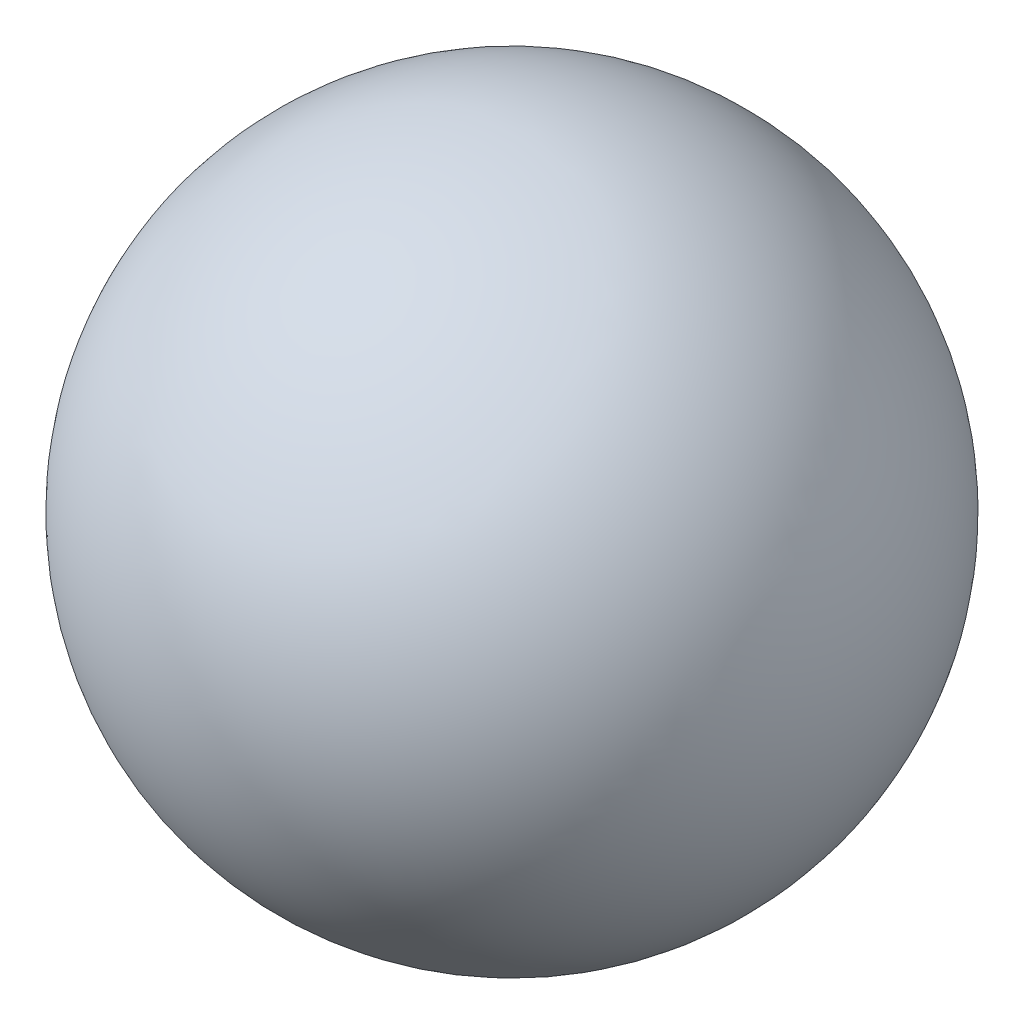
ISO-10303-21;
HEADER;
FILE_DESCRIPTION(('STEP AP214'),'2;1');
FILE_NAME('part.step','',(''),(''),'','','');
FILE_SCHEMA(('AUTOMOTIVE_DESIGN { 1 0 10303 214 1 1 1 1 }'));
ENDSEC;
DATA;
#1=APPLICATION_CONTEXT('core data for automotive mechanical design processes');
#2=APPLICATION_PROTOCOL_DEFINITION('international standard','automotive_design',2000,#1);
#3=PRODUCT_CONTEXT('',#1,'mechanical');
#4=PRODUCT('Part','Part','',(#3));
#5=PRODUCT_RELATED_PRODUCT_CATEGORY('part','',(#4));
#6=PRODUCT_DEFINITION_FORMATION('','',#4);
#7=PRODUCT_DEFINITION_CONTEXT('part definition',#1,'design');
#8=PRODUCT_DEFINITION('design','',#6,#7);
#9=PRODUCT_DEFINITION_SHAPE('','',#8);
#10=(LENGTH_UNIT() NAMED_UNIT(*) SI_UNIT(.MILLI.,.METRE.));
#11=(NAMED_UNIT(*) PLANE_ANGLE_UNIT() SI_UNIT($,.RADIAN.));
#12=(NAMED_UNIT(*) SI_UNIT($,.STERADIAN.) SOLID_ANGLE_UNIT());
#13=UNCERTAINTY_MEASURE_WITH_UNIT(LENGTH_MEASURE(1.E-05),#10,'distance_accuracy_value','');
#14=(GEOMETRIC_REPRESENTATION_CONTEXT(3) GLOBAL_UNCERTAINTY_ASSIGNED_CONTEXT((#13)) GLOBAL_UNIT_ASSIGNED_CONTEXT((#10,
#11,#12)) REPRESENTATION_CONTEXT('',''));
#15=CARTESIAN_POINT('',(0.,0.,0.));
#16=DIRECTION('',(0.,0.,1.));
#17=DIRECTION('',(1.,0.,0.));
#18=AXIS2_PLACEMENT_3D('',#15,#16,#17);
#19=CARTESIAN_POINT('',(0.,0.,0.));
#20=DIRECTION('',(-1.,0.,0.));
#21=DIRECTION('',(0.,1.,0.));
#22=AXIS2_PLACEMENT_3D('',#19,#20,#21);
#23=SPHERICAL_SURFACE('',#22,5.);
#24=CARTESIAN_POINT('',(-5.,0.,0.));
#25=VERTEX_POINT('',#24);
#26=VERTEX_LOOP('',#25);
#27=FACE_BOUND('',#26,.T.);
#28=ADVANCED_FACE('F30',(#27),#23,.T.);
#29=CLOSED_SHELL('',(#28));
#30=CARTESIAN_POINT('',(0.,0.,0.));
#31=DIRECTION('',(-1.,0.,0.));
#32=DIRECTION('',(0.,-1.,0.));
#33=AXIS2_PLACEMENT_3D('',#30,#31,#32);
#34=SPHERICAL_SURFACE('',#33,3.);
#35=CARTESIAN_POINT('',(-3.,0.,0.));
#36=VERTEX_POINT('',#35);
#37=VERTEX_LOOP('',#36);
#38=FACE_BOUND('',#37,.T.);
#39=ADVANCED_FACE('F32',(#38),#34,.F.);
#40=CLOSED_SHELL('',(#39));
#41=ORIENTED_CLOSED_SHELL('',*,#40,.T.);
#42=BREP_WITH_VOIDS('B2',#29,(#41));
#43=ADVANCED_BREP_SHAPE_REPRESENTATION('',(#18,#42),#14);
#44=SHAPE_DEFINITION_REPRESENTATION(#9,#43);
ENDSEC;
END-ISO-10303-21;
